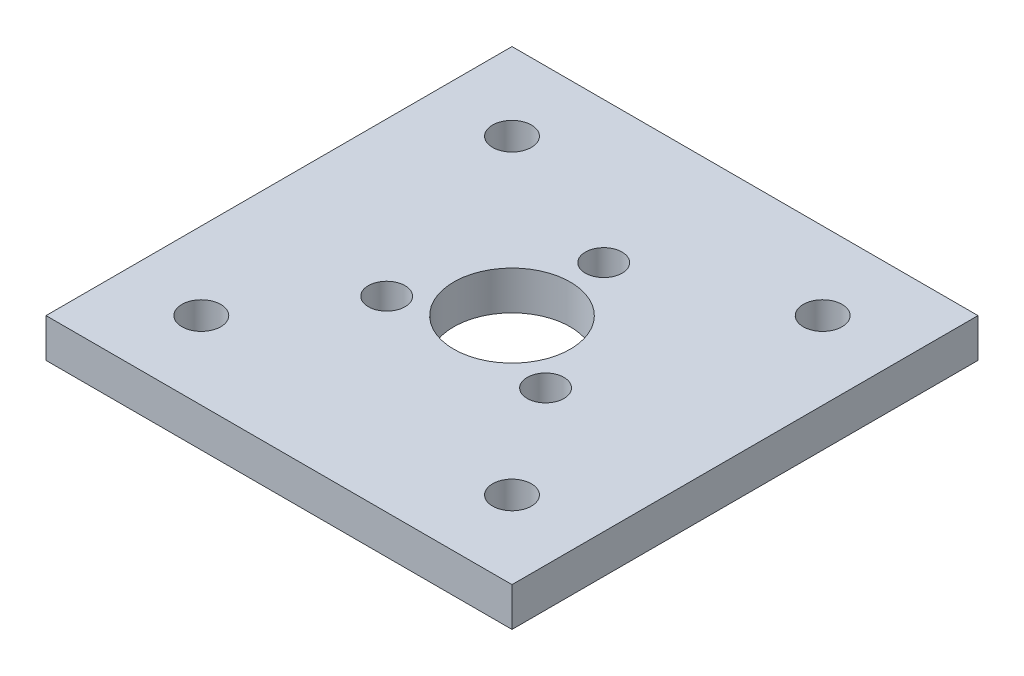
ISO-10303-21;
HEADER;
FILE_DESCRIPTION(('STEP AP214'),'2;1');
FILE_NAME('part.step','',(''),(''),'','','');
FILE_SCHEMA(('AUTOMOTIVE_DESIGN { 1 0 10303 214 1 1 1 1 }'));
ENDSEC;
DATA;
#1=APPLICATION_CONTEXT('core data for automotive mechanical design processes');
#2=APPLICATION_PROTOCOL_DEFINITION('international standard','automotive_design',2000,#1);
#3=PRODUCT_CONTEXT('',#1,'mechanical');
#4=PRODUCT('Part','Part','',(#3));
#5=PRODUCT_RELATED_PRODUCT_CATEGORY('part','',(#4));
#6=PRODUCT_DEFINITION_FORMATION('','',#4);
#7=PRODUCT_DEFINITION_CONTEXT('part definition',#1,'design');
#8=PRODUCT_DEFINITION('design','',#6,#7);
#9=PRODUCT_DEFINITION_SHAPE('','',#8);
#10=(LENGTH_UNIT() NAMED_UNIT(*) SI_UNIT(.MILLI.,.METRE.));
#11=(NAMED_UNIT(*) PLANE_ANGLE_UNIT() SI_UNIT($,.RADIAN.));
#12=(NAMED_UNIT(*) SI_UNIT($,.STERADIAN.) SOLID_ANGLE_UNIT());
#13=UNCERTAINTY_MEASURE_WITH_UNIT(LENGTH_MEASURE(1.E-05),#10,'distance_accuracy_value','');
#14=(GEOMETRIC_REPRESENTATION_CONTEXT(3) GLOBAL_UNCERTAINTY_ASSIGNED_CONTEXT((#13)) GLOBAL_UNIT_ASSIGNED_CONTEXT((#10,
#11,#12)) REPRESENTATION_CONTEXT('',''));
#15=CARTESIAN_POINT('',(0.,0.,0.));
#16=DIRECTION('',(0.,0.,1.));
#17=DIRECTION('',(1.,0.,0.));
#18=AXIS2_PLACEMENT_3D('',#15,#16,#17);
#19=CARTESIAN_POINT('',(19.05,3.175,19.05));
#20=DIRECTION('',(-1.,0.,0.));
#21=DIRECTION('',(0.,0.,1.));
#22=AXIS2_PLACEMENT_3D('',#19,#20,#21);
#23=PLANE('',#22);
#24=DIRECTION('',(0.,0.,-1.));
#25=VECTOR('',#24,1.);
#26=CARTESIAN_POINT('',(19.05,0.,19.05));
#27=LINE('',#26,#25);
#28=CARTESIAN_POINT('',(19.05,0.,19.05));
#29=VERTEX_POINT('',#28);
#30=CARTESIAN_POINT('',(19.05,0.,-19.05));
#31=VERTEX_POINT('',#30);
#32=EDGE_CURVE('E96',#29,#31,#27,.T.);
#33=ORIENTED_EDGE('',*,*,#32,.T.);
#34=DIRECTION('',(0.,-1.,0.));
#35=VECTOR('',#34,1.);
#36=CARTESIAN_POINT('',(19.05,3.175,-19.05));
#37=LINE('',#36,#35);
#38=CARTESIAN_POINT('',(19.05,3.175,-19.05));
#39=VERTEX_POINT('',#38);
#40=EDGE_CURVE('E11',#39,#31,#37,.T.);
#41=ORIENTED_EDGE('',*,*,#40,.F.);
#42=DIRECTION('',(0.,0.,-1.));
#43=VECTOR('',#42,1.);
#44=CARTESIAN_POINT('',(19.05,3.175,19.05));
#45=LINE('',#44,#43);
#46=CARTESIAN_POINT('',(19.05,3.175,19.05));
#47=VERTEX_POINT('',#46);
#48=EDGE_CURVE('E84',#47,#39,#45,.T.);
#49=ORIENTED_EDGE('',*,*,#48,.F.);
#50=DIRECTION('',(0.,-1.,0.));
#51=VECTOR('',#50,1.);
#52=CARTESIAN_POINT('',(19.05,3.175,19.05));
#53=LINE('',#52,#51);
#54=EDGE_CURVE('E92',#47,#29,#53,.T.);
#55=ORIENTED_EDGE('',*,*,#54,.T.);
#56=EDGE_LOOP('',(#33,#41,#49,#55));
#57=FACE_BOUND('',#56,.T.);
#58=ADVANCED_FACE('F33',(#57),#23,.F.);
#59=CARTESIAN_POINT('',(-19.05,3.175,-19.05));
#60=DIRECTION('',(0.,0.,1.));
#61=DIRECTION('',(1.,0.,0.));
#62=AXIS2_PLACEMENT_3D('',#59,#60,#61);
#63=PLANE('',#62);
#64=DIRECTION('',(-1.,0.,0.));
#65=VECTOR('',#64,1.);
#66=CARTESIAN_POINT('',(-19.05,0.,-19.05));
#67=LINE('',#66,#65);
#68=CARTESIAN_POINT('',(-19.05,0.,-19.05));
#69=VERTEX_POINT('',#68);
#70=EDGE_CURVE('E88',#31,#69,#67,.T.);
#71=ORIENTED_EDGE('',*,*,#70,.T.);
#72=DIRECTION('',(0.,-1.,0.));
#73=VECTOR('',#72,1.);
#74=CARTESIAN_POINT('',(-19.05,3.175,-19.05));
#75=LINE('',#74,#73);
#76=CARTESIAN_POINT('',(-19.05,3.175,-19.05));
#77=VERTEX_POINT('',#76);
#78=EDGE_CURVE('E41',#77,#69,#75,.T.);
#79=ORIENTED_EDGE('',*,*,#78,.F.);
#80=DIRECTION('',(-1.,0.,0.));
#81=VECTOR('',#80,1.);
#82=CARTESIAN_POINT('',(-19.05,3.175,-19.05));
#83=LINE('',#82,#81);
#84=EDGE_CURVE('E79',#39,#77,#83,.T.);
#85=ORIENTED_EDGE('',*,*,#84,.F.);
#86=ORIENTED_EDGE('',*,*,#40,.T.);
#87=EDGE_LOOP('',(#71,#79,#85,#86));
#88=FACE_BOUND('',#87,.T.);
#89=ADVANCED_FACE('F87',(#88),#63,.F.);
#90=CARTESIAN_POINT('',(-19.05,3.175,19.05));
#91=DIRECTION('',(1.,0.,0.));
#92=DIRECTION('',(0.,0.,-1.));
#93=AXIS2_PLACEMENT_3D('',#90,#91,#92);
#94=PLANE('',#93);
#95=DIRECTION('',(0.,0.,1.));
#96=VECTOR('',#95,1.);
#97=CARTESIAN_POINT('',(-19.05,0.,19.05));
#98=LINE('',#97,#96);
#99=CARTESIAN_POINT('',(-19.05,0.,19.05));
#100=VERTEX_POINT('',#99);
#101=EDGE_CURVE('E66',#69,#100,#98,.T.);
#102=ORIENTED_EDGE('',*,*,#101,.T.);
#103=DIRECTION('',(0.,-1.,0.));
#104=VECTOR('',#103,1.);
#105=CARTESIAN_POINT('',(-19.05,3.175,19.05));
#106=LINE('',#105,#104);
#107=CARTESIAN_POINT('',(-19.05,3.175,19.05));
#108=VERTEX_POINT('',#107);
#109=EDGE_CURVE('E89',#108,#100,#106,.T.);
#110=ORIENTED_EDGE('',*,*,#109,.F.);
#111=DIRECTION('',(0.,0.,1.));
#112=VECTOR('',#111,1.);
#113=CARTESIAN_POINT('',(-19.05,3.175,19.05));
#114=LINE('',#113,#112);
#115=EDGE_CURVE('E82',#77,#108,#114,.T.);
#116=ORIENTED_EDGE('',*,*,#115,.F.);
#117=ORIENTED_EDGE('',*,*,#78,.T.);
#118=EDGE_LOOP('',(#102,#110,#116,#117));
#119=FACE_BOUND('',#118,.T.);
#120=ADVANCED_FACE('F90',(#119),#94,.F.);
#121=CARTESIAN_POINT('',(-19.05,3.175,19.05));
#122=DIRECTION('',(0.,0.,-1.));
#123=DIRECTION('',(-1.,0.,0.));
#124=AXIS2_PLACEMENT_3D('',#121,#122,#123);
#125=PLANE('',#124);
#126=DIRECTION('',(1.,0.,0.));
#127=VECTOR('',#126,1.);
#128=CARTESIAN_POINT('',(-19.05,0.,19.05));
#129=LINE('',#128,#127);
#130=EDGE_CURVE('E72',#100,#29,#129,.T.);
#131=ORIENTED_EDGE('',*,*,#130,.T.);
#132=ORIENTED_EDGE('',*,*,#54,.F.);
#133=DIRECTION('',(1.,0.,0.));
#134=VECTOR('',#133,1.);
#135=CARTESIAN_POINT('',(-19.05,3.175,19.05));
#136=LINE('',#135,#134);
#137=EDGE_CURVE('E49',#108,#47,#136,.T.);
#138=ORIENTED_EDGE('',*,*,#137,.F.);
#139=ORIENTED_EDGE('',*,*,#109,.T.);
#140=EDGE_LOOP('',(#131,#132,#138,#139));
#141=FACE_BOUND('',#140,.T.);
#142=ADVANCED_FACE('F104',(#141),#125,.F.);
#143=CARTESIAN_POINT('',(0.,3.175,0.));
#144=DIRECTION('',(0.,-1.,0.));
#145=DIRECTION('',(0.,0.,-1.));
#146=AXIS2_PLACEMENT_3D('',#143,#144,#145);
#147=PLANE('',#146);
#148=CARTESIAN_POINT('',(12.7,3.175,-12.7));
#149=DIRECTION('',(0.,1.,0.));
#150=DIRECTION('',(0.,0.,1.));
#151=AXIS2_PLACEMENT_3D('',#148,#149,#150);
#152=CIRCLE('',#151,1.5875);
#153=CARTESIAN_POINT('',(12.7,3.175,-11.1125));
#154=VERTEX_POINT('',#153);
#155=EDGE_CURVE('E140',#154,#154,#152,.T.);
#156=ORIENTED_EDGE('',*,*,#155,.F.);
#157=EDGE_LOOP('',(#156));
#158=FACE_BOUND('',#157,.T.);
#159=CARTESIAN_POINT('',(12.7000000000003,3.175,12.7));
#160=DIRECTION('',(0.,1.,0.));
#161=DIRECTION('',(0.,0.,1.));
#162=AXIS2_PLACEMENT_3D('',#159,#160,#161);
#163=CIRCLE('',#162,1.5875);
#164=CARTESIAN_POINT('',(12.7000000000003,3.175,14.2875));
#165=VERTEX_POINT('',#164);
#166=EDGE_CURVE('E146',#165,#165,#163,.T.);
#167=ORIENTED_EDGE('',*,*,#166,.F.);
#168=EDGE_LOOP('',(#167));
#169=FACE_BOUND('',#168,.T.);
#170=CARTESIAN_POINT('',(-12.6999999999997,3.175,12.7));
#171=DIRECTION('',(0.,1.,0.));
#172=DIRECTION('',(0.,0.,1.));
#173=AXIS2_PLACEMENT_3D('',#170,#171,#172);
#174=CIRCLE('',#173,1.5875);
#175=CARTESIAN_POINT('',(-12.6999999999997,3.175,14.2875));
#176=VERTEX_POINT('',#175);
#177=EDGE_CURVE('E152',#176,#176,#174,.T.);
#178=ORIENTED_EDGE('',*,*,#177,.F.);
#179=EDGE_LOOP('',(#178));
#180=FACE_BOUND('',#179,.T.);
#181=CARTESIAN_POINT('',(-12.7,3.175,-12.7));
#182=DIRECTION('',(0.,1.,0.));
#183=DIRECTION('',(0.,0.,1.));
#184=AXIS2_PLACEMENT_3D('',#181,#182,#183);
#185=CIRCLE('',#184,1.5875);
#186=CARTESIAN_POINT('',(-12.7,3.175,-11.1125));
#187=VERTEX_POINT('',#186);
#188=EDGE_CURVE('E134',#187,#187,#185,.T.);
#189=ORIENTED_EDGE('',*,*,#188,.F.);
#190=EDGE_LOOP('',(#189));
#191=FACE_BOUND('',#190,.T.);
#192=CARTESIAN_POINT('',(0.,3.175,-7.5));
#193=DIRECTION('',(0.,1.,0.));
#194=DIRECTION('',(0.,0.,1.));
#195=AXIS2_PLACEMENT_3D('',#192,#193,#194);
#196=CIRCLE('',#195,1.5);
#197=CARTESIAN_POINT('',(0.,3.175,-6.));
#198=VERTEX_POINT('',#197);
#199=EDGE_CURVE('E123',#198,#198,#196,.T.);
#200=ORIENTED_EDGE('',*,*,#199,.F.);
#201=EDGE_LOOP('',(#200));
#202=FACE_BOUND('',#201,.T.);
#203=CARTESIAN_POINT('',(0.,3.175,0.));
#204=DIRECTION('',(0.,1.,0.));
#205=DIRECTION('',(0.,0.,1.));
#206=AXIS2_PLACEMENT_3D('',#203,#204,#205);
#207=CIRCLE('',#206,4.7625);
#208=CARTESIAN_POINT('',(0.,3.175,4.7625));
#209=VERTEX_POINT('',#208);
#210=EDGE_CURVE('E114',#209,#209,#207,.T.);
#211=ORIENTED_EDGE('',*,*,#210,.F.);
#212=EDGE_LOOP('',(#211));
#213=FACE_BOUND('',#212,.T.);
#214=CARTESIAN_POINT('',(6.49519052838386,3.175,3.74999999999966));
#215=DIRECTION('',(0.,1.,0.));
#216=DIRECTION('',(0.,0.,1.));
#217=AXIS2_PLACEMENT_3D('',#214,#215,#216);
#218=CIRCLE('',#217,1.5);
#219=CARTESIAN_POINT('',(6.49519052838386,3.175,5.24999999999966));
#220=VERTEX_POINT('',#219);
#221=EDGE_CURVE('E113',#220,#220,#218,.T.);
#222=ORIENTED_EDGE('',*,*,#221,.F.);
#223=EDGE_LOOP('',(#222));
#224=FACE_BOUND('',#223,.T.);
#225=CARTESIAN_POINT('',(-6.49519052838272,3.175,3.75000000000033));
#226=DIRECTION('',(0.,1.,0.));
#227=DIRECTION('',(0.,0.,1.));
#228=AXIS2_PLACEMENT_3D('',#225,#226,#227);
#229=CIRCLE('',#228,1.5);
#230=CARTESIAN_POINT('',(-6.49519052838272,3.175,5.25000000000033));
#231=VERTEX_POINT('',#230);
#232=EDGE_CURVE('E120',#231,#231,#229,.T.);
#233=ORIENTED_EDGE('',*,*,#232,.F.);
#234=EDGE_LOOP('',(#233));
#235=FACE_BOUND('',#234,.T.);
#236=ORIENTED_EDGE('',*,*,#48,.T.);
#237=ORIENTED_EDGE('',*,*,#84,.T.);
#238=ORIENTED_EDGE('',*,*,#115,.T.);
#239=ORIENTED_EDGE('',*,*,#137,.T.);
#240=EDGE_LOOP('',(#236,#237,#238,#239));
#241=FACE_BOUND('',#240,.T.);
#242=ADVANCED_FACE('F80',(#158,#169,#180,#191,#202,#213,#224,#235,#241),#147,.F.);
#243=CARTESIAN_POINT('',(0.,0.,0.));
#244=DIRECTION('',(0.,-1.,0.));
#245=DIRECTION('',(0.,0.,-1.));
#246=AXIS2_PLACEMENT_3D('',#243,#244,#245);
#247=PLANE('',#246);
#248=CARTESIAN_POINT('',(12.7,0.,-12.7));
#249=DIRECTION('',(0.,1.,0.));
#250=DIRECTION('',(0.,0.,1.));
#251=AXIS2_PLACEMENT_3D('',#248,#249,#250);
#252=CIRCLE('',#251,1.5875);
#253=CARTESIAN_POINT('',(12.7,0.,-11.1125));
#254=VERTEX_POINT('',#253);
#255=EDGE_CURVE('E143',#254,#254,#252,.T.);
#256=ORIENTED_EDGE('',*,*,#255,.T.);
#257=EDGE_LOOP('',(#256));
#258=FACE_BOUND('',#257,.T.);
#259=CARTESIAN_POINT('',(12.7000000000003,0.,12.7));
#260=DIRECTION('',(0.,1.,0.));
#261=DIRECTION('',(0.,0.,1.));
#262=AXIS2_PLACEMENT_3D('',#259,#260,#261);
#263=CIRCLE('',#262,1.5875);
#264=CARTESIAN_POINT('',(12.7000000000003,0.,14.2875));
#265=VERTEX_POINT('',#264);
#266=EDGE_CURVE('E149',#265,#265,#263,.T.);
#267=ORIENTED_EDGE('',*,*,#266,.T.);
#268=EDGE_LOOP('',(#267));
#269=FACE_BOUND('',#268,.T.);
#270=CARTESIAN_POINT('',(-12.6999999999997,0.,12.7));
#271=DIRECTION('',(0.,1.,0.));
#272=DIRECTION('',(0.,0.,1.));
#273=AXIS2_PLACEMENT_3D('',#270,#271,#272);
#274=CIRCLE('',#273,1.5875);
#275=CARTESIAN_POINT('',(-12.6999999999997,0.,14.2875));
#276=VERTEX_POINT('',#275);
#277=EDGE_CURVE('E137',#276,#276,#274,.T.);
#278=ORIENTED_EDGE('',*,*,#277,.T.);
#279=EDGE_LOOP('',(#278));
#280=FACE_BOUND('',#279,.T.);
#281=CARTESIAN_POINT('',(-12.7,0.,-12.7));
#282=DIRECTION('',(0.,1.,0.));
#283=DIRECTION('',(0.,0.,1.));
#284=AXIS2_PLACEMENT_3D('',#281,#282,#283);
#285=CIRCLE('',#284,1.5875);
#286=CARTESIAN_POINT('',(-12.7,0.,-11.1125));
#287=VERTEX_POINT('',#286);
#288=EDGE_CURVE('E127',#287,#287,#285,.T.);
#289=ORIENTED_EDGE('',*,*,#288,.T.);
#290=EDGE_LOOP('',(#289));
#291=FACE_BOUND('',#290,.T.);
#292=CARTESIAN_POINT('',(0.,0.,-7.5));
#293=DIRECTION('',(0.,1.,0.));
#294=DIRECTION('',(0.,0.,1.));
#295=AXIS2_PLACEMENT_3D('',#292,#293,#294);
#296=CIRCLE('',#295,1.5);
#297=CARTESIAN_POINT('',(0.,0.,-6.));
#298=VERTEX_POINT('',#297);
#299=EDGE_CURVE('E99',#298,#298,#296,.T.);
#300=ORIENTED_EDGE('',*,*,#299,.T.);
#301=EDGE_LOOP('',(#300));
#302=FACE_BOUND('',#301,.T.);
#303=CARTESIAN_POINT('',(0.,0.,0.));
#304=DIRECTION('',(0.,1.,0.));
#305=DIRECTION('',(0.,0.,1.));
#306=AXIS2_PLACEMENT_3D('',#303,#304,#305);
#307=CIRCLE('',#306,4.7625);
#308=CARTESIAN_POINT('',(0.,0.,4.7625));
#309=VERTEX_POINT('',#308);
#310=EDGE_CURVE('E124',#309,#309,#307,.T.);
#311=ORIENTED_EDGE('',*,*,#310,.T.);
#312=EDGE_LOOP('',(#311));
#313=FACE_BOUND('',#312,.T.);
#314=CARTESIAN_POINT('',(6.49519052838386,0.,3.74999999999966));
#315=DIRECTION('',(0.,1.,0.));
#316=DIRECTION('',(0.,0.,1.));
#317=AXIS2_PLACEMENT_3D('',#314,#315,#316);
#318=CIRCLE('',#317,1.5);
#319=CARTESIAN_POINT('',(6.49519052838386,0.,5.24999999999966));
#320=VERTEX_POINT('',#319);
#321=EDGE_CURVE('E110',#320,#320,#318,.T.);
#322=ORIENTED_EDGE('',*,*,#321,.T.);
#323=EDGE_LOOP('',(#322));
#324=FACE_BOUND('',#323,.T.);
#325=CARTESIAN_POINT('',(-6.49519052838272,0.,3.75000000000033));
#326=DIRECTION('',(0.,1.,0.));
#327=DIRECTION('',(0.,0.,1.));
#328=AXIS2_PLACEMENT_3D('',#325,#326,#327);
#329=CIRCLE('',#328,1.5);
#330=CARTESIAN_POINT('',(-6.49519052838272,0.,5.25000000000033));
#331=VERTEX_POINT('',#330);
#332=EDGE_CURVE('E117',#331,#331,#329,.T.);
#333=ORIENTED_EDGE('',*,*,#332,.T.);
#334=EDGE_LOOP('',(#333));
#335=FACE_BOUND('',#334,.T.);
#336=ORIENTED_EDGE('',*,*,#32,.F.);
#337=ORIENTED_EDGE('',*,*,#130,.F.);
#338=ORIENTED_EDGE('',*,*,#101,.F.);
#339=ORIENTED_EDGE('',*,*,#70,.F.);
#340=EDGE_LOOP('',(#336,#337,#338,#339));
#341=FACE_BOUND('',#340,.T.);
#342=ADVANCED_FACE('F107',(#258,#269,#280,#291,#302,#313,#324,#335,#341),#247,.T.);
#343=CARTESIAN_POINT('',(-6.49519052838272,0.,3.75000000000033));
#344=DIRECTION('',(0.,1.,0.));
#345=DIRECTION('',(0.,0.,1.));
#346=AXIS2_PLACEMENT_3D('',#343,#344,#345);
#347=CYLINDRICAL_SURFACE('',#346,1.5);
#348=ORIENTED_EDGE('',*,*,#332,.F.);
#349=EDGE_LOOP('',(#348));
#350=FACE_BOUND('',#349,.T.);
#351=ORIENTED_EDGE('',*,*,#232,.T.);
#352=EDGE_LOOP('',(#351));
#353=FACE_BOUND('',#352,.T.);
#354=ADVANCED_FACE('F182',(#350,#353),#347,.F.);
#355=CARTESIAN_POINT('',(6.49519052838386,0.,3.74999999999966));
#356=DIRECTION('',(0.,1.,0.));
#357=DIRECTION('',(0.,0.,1.));
#358=AXIS2_PLACEMENT_3D('',#355,#356,#357);
#359=CYLINDRICAL_SURFACE('',#358,1.5);
#360=ORIENTED_EDGE('',*,*,#321,.F.);
#361=EDGE_LOOP('',(#360));
#362=FACE_BOUND('',#361,.T.);
#363=ORIENTED_EDGE('',*,*,#221,.T.);
#364=EDGE_LOOP('',(#363));
#365=FACE_BOUND('',#364,.T.);
#366=ADVANCED_FACE('F184',(#362,#365),#359,.F.);
#367=CARTESIAN_POINT('',(0.,0.,0.));
#368=DIRECTION('',(0.,1.,0.));
#369=DIRECTION('',(0.,0.,1.));
#370=AXIS2_PLACEMENT_3D('',#367,#368,#369);
#371=CYLINDRICAL_SURFACE('',#370,4.7625);
#372=ORIENTED_EDGE('',*,*,#310,.F.);
#373=EDGE_LOOP('',(#372));
#374=FACE_BOUND('',#373,.T.);
#375=ORIENTED_EDGE('',*,*,#210,.T.);
#376=EDGE_LOOP('',(#375));
#377=FACE_BOUND('',#376,.T.);
#378=ADVANCED_FACE('F191',(#374,#377),#371,.F.);
#379=CARTESIAN_POINT('',(0.,0.,-7.5));
#380=DIRECTION('',(0.,1.,0.));
#381=DIRECTION('',(0.,0.,1.));
#382=AXIS2_PLACEMENT_3D('',#379,#380,#381);
#383=CYLINDRICAL_SURFACE('',#382,1.5);
#384=ORIENTED_EDGE('',*,*,#299,.F.);
#385=EDGE_LOOP('',(#384));
#386=FACE_BOUND('',#385,.T.);
#387=ORIENTED_EDGE('',*,*,#199,.T.);
#388=EDGE_LOOP('',(#387));
#389=FACE_BOUND('',#388,.T.);
#390=ADVANCED_FACE('F231',(#386,#389),#383,.F.);
#391=CARTESIAN_POINT('',(-12.7,0.,-12.7));
#392=DIRECTION('',(0.,1.,0.));
#393=DIRECTION('',(0.,0.,1.));
#394=AXIS2_PLACEMENT_3D('',#391,#392,#393);
#395=CYLINDRICAL_SURFACE('',#394,1.5875);
#396=ORIENTED_EDGE('',*,*,#288,.F.);
#397=EDGE_LOOP('',(#396));
#398=FACE_BOUND('',#397,.T.);
#399=ORIENTED_EDGE('',*,*,#188,.T.);
#400=EDGE_LOOP('',(#399));
#401=FACE_BOUND('',#400,.T.);
#402=ADVANCED_FACE('F164',(#398,#401),#395,.F.);
#403=CARTESIAN_POINT('',(-12.6999999999997,0.,12.7));
#404=DIRECTION('',(0.,1.,0.));
#405=DIRECTION('',(0.,0.,1.));
#406=AXIS2_PLACEMENT_3D('',#403,#404,#405);
#407=CYLINDRICAL_SURFACE('',#406,1.5875);
#408=ORIENTED_EDGE('',*,*,#277,.F.);
#409=EDGE_LOOP('',(#408));
#410=FACE_BOUND('',#409,.T.);
#411=ORIENTED_EDGE('',*,*,#177,.T.);
#412=EDGE_LOOP('',(#411));
#413=FACE_BOUND('',#412,.T.);
#414=ADVANCED_FACE('F160',(#410,#413),#407,.F.);
#415=CARTESIAN_POINT('',(12.7000000000003,0.,12.7));
#416=DIRECTION('',(0.,1.,0.));
#417=DIRECTION('',(0.,0.,1.));
#418=AXIS2_PLACEMENT_3D('',#415,#416,#417);
#419=CYLINDRICAL_SURFACE('',#418,1.5875);
#420=ORIENTED_EDGE('',*,*,#266,.F.);
#421=EDGE_LOOP('',(#420));
#422=FACE_BOUND('',#421,.T.);
#423=ORIENTED_EDGE('',*,*,#166,.T.);
#424=EDGE_LOOP('',(#423));
#425=FACE_BOUND('',#424,.T.);
#426=ADVANCED_FACE('F163',(#422,#425),#419,.F.);
#427=CARTESIAN_POINT('',(12.7,0.,-12.7));
#428=DIRECTION('',(0.,1.,0.));
#429=DIRECTION('',(0.,0.,1.));
#430=AXIS2_PLACEMENT_3D('',#427,#428,#429);
#431=CYLINDRICAL_SURFACE('',#430,1.5875);
#432=ORIENTED_EDGE('',*,*,#255,.F.);
#433=EDGE_LOOP('',(#432));
#434=FACE_BOUND('',#433,.T.);
#435=ORIENTED_EDGE('',*,*,#155,.T.);
#436=EDGE_LOOP('',(#435));
#437=FACE_BOUND('',#436,.T.);
#438=ADVANCED_FACE('F249',(#434,#437),#431,.F.);
#439=CLOSED_SHELL('',(#58,#89,#120,#142,#242,#342,#354,#366,#378,#390,#402,#414,#426,#438));
#440=MANIFOLD_SOLID_BREP('B2',#439);
#441=ADVANCED_BREP_SHAPE_REPRESENTATION('',(#18,#440),#14);
#442=SHAPE_DEFINITION_REPRESENTATION(#9,#441);
ENDSEC;
END-ISO-10303-21;
